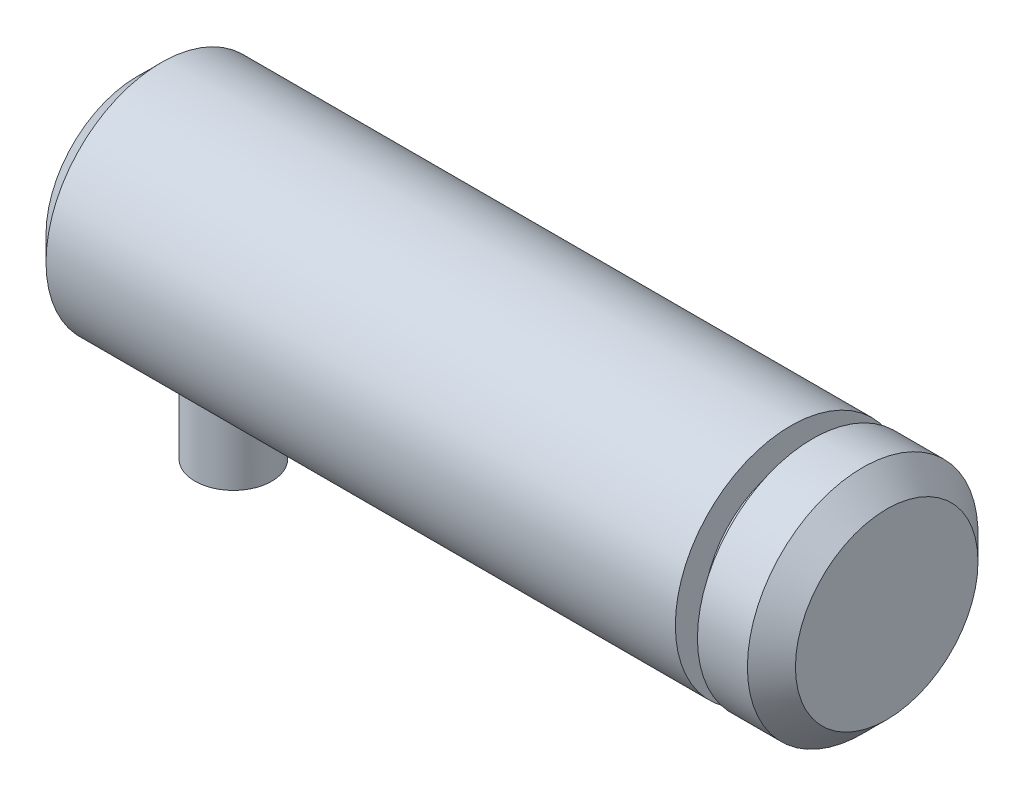
ISO-10303-21;
HEADER;
FILE_DESCRIPTION(('STEP AP214'),'2;1');
FILE_NAME('part.step','',(''),(''),'','','');
FILE_SCHEMA(('AUTOMOTIVE_DESIGN { 1 0 10303 214 1 1 1 1 }'));
ENDSEC;
DATA;
#1=APPLICATION_CONTEXT('core data for automotive mechanical design processes');
#2=APPLICATION_PROTOCOL_DEFINITION('international standard','automotive_design',2000,#1);
#3=PRODUCT_CONTEXT('',#1,'mechanical');
#4=PRODUCT('Part','Part','',(#3));
#5=PRODUCT_RELATED_PRODUCT_CATEGORY('part','',(#4));
#6=PRODUCT_DEFINITION_FORMATION('','',#4);
#7=PRODUCT_DEFINITION_CONTEXT('part definition',#1,'design');
#8=PRODUCT_DEFINITION('design','',#6,#7);
#9=PRODUCT_DEFINITION_SHAPE('','',#8);
#10=(LENGTH_UNIT() NAMED_UNIT(*) SI_UNIT(.MILLI.,.METRE.));
#11=(NAMED_UNIT(*) PLANE_ANGLE_UNIT() SI_UNIT($,.RADIAN.));
#12=(NAMED_UNIT(*) SI_UNIT($,.STERADIAN.) SOLID_ANGLE_UNIT());
#13=UNCERTAINTY_MEASURE_WITH_UNIT(LENGTH_MEASURE(1.E-05),#10,'distance_accuracy_value','');
#14=(GEOMETRIC_REPRESENTATION_CONTEXT(3) GLOBAL_UNCERTAINTY_ASSIGNED_CONTEXT((#13)) GLOBAL_UNIT_ASSIGNED_CONTEXT((#10,
#11,#12)) REPRESENTATION_CONTEXT('',''));
#15=CARTESIAN_POINT('',(0.,0.,0.));
#16=DIRECTION('',(0.,0.,1.));
#17=DIRECTION('',(1.,0.,0.));
#18=AXIS2_PLACEMENT_3D('',#15,#16,#17);
#19=CARTESIAN_POINT('',(14.5,0.,0.));
#20=DIRECTION('',(-1.,0.,0.));
#21=DIRECTION('',(0.,0.,1.));
#22=AXIS2_PLACEMENT_3D('',#19,#20,#21);
#23=CYLINDRICAL_SURFACE('',#22,6.);
#24=CARTESIAN_POINT('',(15.65,0.,0.));
#25=DIRECTION('',(-1.,0.,0.));
#26=DIRECTION('',(0.,0.,1.));
#27=AXIS2_PLACEMENT_3D('',#24,#25,#26);
#28=CIRCLE('',#27,6.);
#29=CARTESIAN_POINT('',(15.65,0.,6.));
#30=VERTEX_POINT('',#29);
#31=EDGE_CURVE('E58',#30,#30,#28,.T.);
#32=ORIENTED_EDGE('',*,*,#31,.F.);
#33=EDGE_LOOP('',(#32));
#34=FACE_BOUND('',#33,.T.);
#35=CARTESIAN_POINT('',(18.25,0.,0.));
#36=DIRECTION('',(-1.,0.,0.));
#37=DIRECTION('',(0.,0.,1.));
#38=AXIS2_PLACEMENT_3D('',#35,#36,#37);
#39=CIRCLE('',#38,6.);
#40=CARTESIAN_POINT('',(18.25,0.,6.));
#41=VERTEX_POINT('',#40);
#42=EDGE_CURVE('E67',#41,#41,#39,.T.);
#43=ORIENTED_EDGE('',*,*,#42,.T.);
#44=EDGE_LOOP('',(#43));
#45=FACE_BOUND('',#44,.T.);
#46=ADVANCED_FACE('F31',(#34,#45),#23,.T.);
#47=CARTESIAN_POINT('',(-18.25,0.,0.));
#48=DIRECTION('',(-1.,0.,0.));
#49=DIRECTION('',(0.,0.,1.));
#50=AXIS2_PLACEMENT_3D('',#47,#48,#49);
#51=CIRCLE('',#50,6.);
#52=CARTESIAN_POINT('',(-18.25,0.,6.));
#53=VERTEX_POINT('',#52);
#54=EDGE_CURVE('E10',#53,#53,#51,.T.);
#55=ORIENTED_EDGE('',*,*,#54,.F.);
#56=EDGE_LOOP('',(#55));
#57=FACE_BOUND('',#56,.T.);
#58=CARTESIAN_POINT('',(-14.5,-5.65685424949238,2.));
#59=CARTESIAN_POINT('',(-14.3910636503279,-5.65685389060868,2.00000051589543));
#60=CARTESIAN_POINT('',(-14.2821304003528,-5.66003538581715,1.99106956737105));
#61=CARTESIAN_POINT('',(-14.0674911580115,-5.6723514816251,1.95570226337762));
#62=CARTESIAN_POINT('',(-13.9617857002551,-5.68148706284377,1.92926302433679));
#63=CARTESIAN_POINT('',(-13.7567462140054,-5.70456407377583,1.85991097136981));
#64=CARTESIAN_POINT('',(-13.6574001411146,-5.71849607942644,1.81703044280649));
#65=CARTESIAN_POINT('',(-13.4672799029041,-5.74958244020649,1.71612325688276));
#66=CARTESIAN_POINT('',(-13.3765076348927,-5.76673750607225,1.65809325772037));
#67=CARTESIAN_POINT('',(-13.2025600753234,-5.80308978814946,1.52610229288575));
#68=CARTESIAN_POINT('',(-13.1197691426565,-5.82233789689288,1.45164868275584));
#69=CARTESIAN_POINT('',(-12.9675863975507,-5.86027729602006,1.28997533442879));
#70=CARTESIAN_POINT('',(-12.8981967368353,-5.87896849657923,1.20275355010475));
#71=CARTESIAN_POINT('',(-12.7730422053408,-5.91427733843598,1.01520901593002));
#72=CARTESIAN_POINT('',(-12.7176800587641,-5.93082815403211,0.914603822449048));
#73=CARTESIAN_POINT('',(-12.624816829745,-5.95939173541966,0.704862445974945));
#74=CARTESIAN_POINT('',(-12.5873109336462,-5.97140572406004,0.595728571374421));
#75=CARTESIAN_POINT('',(-12.5325282907352,-5.98918150863813,0.376057634866986));
#76=CARTESIAN_POINT('',(-12.514593107486,-5.99514629555118,0.265701509705934));
#77=CARTESIAN_POINT('',(-12.4973674132787,-6.00087216436496,0.0433957496481764));
#78=CARTESIAN_POINT('',(-12.4980720966952,-6.00063484525791,-0.0685534670877952));
#79=CARTESIAN_POINT('',(-12.5176885091321,-5.99412079237463,-0.286207030387632));
#80=CARTESIAN_POINT('',(-12.535885056949,-5.98808129510235,-0.391984097183315));
#81=CARTESIAN_POINT('',(-12.5887859619609,-5.97093934679463,-0.598886877644346));
#82=CARTESIAN_POINT('',(-12.6234914379597,-5.95983655262363,-0.700012275558434));
#83=CARTESIAN_POINT('',(-12.7088426346121,-5.93351340586448,-0.896304949683948));
#84=CARTESIAN_POINT('',(-12.759691877093,-5.91824085048031,-0.991376441937692));
#85=CARTESIAN_POINT('',(-12.8757194108973,-5.88516786077838,-1.17184865105465));
#86=CARTESIAN_POINT('',(-12.9409016866553,-5.86736672402934,-1.25724666877068));
#87=CARTESIAN_POINT('',(-13.0873487869194,-5.83012383699793,-1.42020173310262));
#88=CARTESIAN_POINT('',(-13.169226315683,-5.81064430337755,-1.49720031413055));
#89=CARTESIAN_POINT('',(-13.3448974514532,-5.77294670497801,-1.63655451919635));
#90=CARTESIAN_POINT('',(-13.4386928914561,-5.75472883491231,-1.69890788656309));
#91=CARTESIAN_POINT('',(-13.6373072512069,-5.72141050242224,-1.80797491007149));
#92=CARTESIAN_POINT('',(-13.7422642626356,-5.70635818569496,-1.85445292724268));
#93=CARTESIAN_POINT('',(-13.9591427884288,-5.68163301648769,-1.92888638653867));
#94=CARTESIAN_POINT('',(-14.0710613624125,-5.67195790974185,-1.95684959149499));
#95=CARTESIAN_POINT('',(-14.2932767108232,-5.6595927263117,-1.99232256419504));
#96=CARTESIAN_POINT('',(-14.4034188494973,-5.65660720637512,-2.00069819101527));
#97=CARTESIAN_POINT('',(-14.6235522982282,-5.65713344118369,-1.99921087781944));
#98=CARTESIAN_POINT('',(-14.733543632048,-5.66064401583629,-1.98935125045353));
#99=CARTESIAN_POINT('',(-14.9463139314238,-5.67347236180599,-1.95245130310462));
#100=CARTESIAN_POINT('',(-15.0492108603017,-5.68258650881681,-1.92601278796137));
#101=CARTESIAN_POINT('',(-15.2490872124784,-5.70537107342046,-1.85742772512093));
#102=CARTESIAN_POINT('',(-15.3460655831816,-5.71904229869679,-1.81527839272684));
#103=CARTESIAN_POINT('',(-15.534760841694,-5.74993755191574,-1.71494868147787));
#104=CARTESIAN_POINT('',(-15.6262132852836,-5.76726051331257,-1.65630223671699));
#105=CARTESIAN_POINT('',(-15.7982921047674,-5.8033153746193,-1.52517126111512));
#106=CARTESIAN_POINT('',(-15.8789152773224,-5.82204768887589,-1.45268265099756));
#107=CARTESIAN_POINT('',(-16.0310559681813,-5.85990077275698,-1.29178341180065));
#108=CARTESIAN_POINT('',(-16.1019487800377,-5.87899687155793,-1.2027745410933));
#109=CARTESIAN_POINT('',(-16.2278322846961,-5.91453703226217,-1.01365458280051));
#110=CARTESIAN_POINT('',(-16.2828235423248,-5.93098118835389,-0.913543889729102));
#111=CARTESIAN_POINT('',(-16.3748402097234,-5.95928811621206,-0.705559724864588));
#112=CARTESIAN_POINT('',(-16.4119825542961,-5.97118060009062,-0.59774224664239));
#113=CARTESIAN_POINT('',(-16.4674554841202,-5.98917221675549,-0.37691693169203));
#114=CARTESIAN_POINT('',(-16.485792859761,-5.99527344068037,-0.263910983907776));
#115=CARTESIAN_POINT('',(-16.5025241552113,-6.00083726472513,-0.0416306717200793));
#116=CARTESIAN_POINT('',(-16.5018149078648,-6.00059840178878,0.0675694478400396));
#117=CARTESIAN_POINT('',(-16.4826853837072,-5.99424393038796,0.28422229000035));
#118=CARTESIAN_POINT('',(-16.4642665436945,-5.98812879867152,0.391675153638115));
#119=CARTESIAN_POINT('',(-16.4108355308481,-5.97081829908825,0.600084238864119));
#120=CARTESIAN_POINT('',(-16.3760915692941,-5.95970516722297,0.70111654182558));
#121=CARTESIAN_POINT('',(-16.2912449378057,-5.9335432140899,0.895956701879593));
#122=CARTESIAN_POINT('',(-16.241139489606,-5.91849368096033,0.989763248284866));
#123=CARTESIAN_POINT('',(-16.124860975796,-5.88531737655762,1.17126803261757));
#124=CARTESIAN_POINT('',(-16.0581626292367,-5.86709744983853,1.25861250311522));
#125=CARTESIAN_POINT('',(-15.9114852176876,-5.82985977583759,1.42116205254486));
#126=CARTESIAN_POINT('',(-15.8315019154745,-5.81084177546194,1.49636324324919));
#127=CARTESIAN_POINT('',(-15.6567812888261,-5.77326559651196,1.63548361766624));
#128=CARTESIAN_POINT('',(-15.5615889780467,-5.75475455977261,1.6988459319958));
#129=CARTESIAN_POINT('',(-15.3613311461944,-5.72120386646031,1.80862868660223));
#130=CARTESIAN_POINT('',(-15.2562682139407,-5.70616330322499,1.85505355363895));
#131=CARTESIAN_POINT('',(-15.0440763519687,-5.68202668413029,1.92768765640833));
#132=CARTESIAN_POINT('',(-14.9372554729493,-5.67269265714364,1.95471581829904));
#133=CARTESIAN_POINT('',(-14.7202878990666,-5.66010767079036,1.99086864029853));
#134=CARTESIAN_POINT('',(-14.6101423651786,-5.65685461234922,1.99999947839318));
#135=CARTESIAN_POINT('',(-14.5,-5.65685424949238,2.));
#136=B_SPLINE_CURVE_WITH_KNOTS('',3,(#58,#59,#60,#61,#62,#63,#64,#65,#66,#67,#68,#69,#70,#71,
#72,#73,#74,#75,#76,#77,#78,#79,#80,#81,#82,#83,#84,#85,#86,#87,#88,#89,#90,#91,#92,#93,#94,#95,
#96,#97,#98,#99,#100,#101,#102,#103,#104,#105,#106,#107,#108,#109,#110,#111,#112,#113,#114,#115,
#116,#117,#118,#119,#120,#121,#122,#123,#124,#125,#126,#127,#128,#129,#130,#131,#132,#133,#134,
#135),.UNSPECIFIED.,.T.,.F.,(4,2,2,2,2,2,2,2,2,2,2,2,2,2,2,2,2,2,2,2,2,2,2,2,2,2,2,2,2,2,2,2,2,
2,2,2,2,2,4),(0.,0.326401169598712,0.652856110030329,0.978673255001655,1.30456233237089,
1.64202674855136,1.97954530343976,2.32587012287315,2.67210152773578,3.00628637529869,
3.34038506604655,3.66138009651138,3.98239688378474,4.3076330972067,4.63295983748044,
4.97360348727835,5.31429959224212,5.65985279686111,6.00526102713232,6.33508582728879,
6.66485071674468,6.98328791537553,7.30178158293892,7.6303771547143,7.95906971324255,
8.30357616342185,8.64807037515065,8.99027582381703,9.33235766008313,9.65836169355271,
9.98433928019562,10.3051391208086,10.6259970152649,10.9587103904127,11.2915300886526,
11.6373780547229,11.9831355653373,12.3132642432538,12.6432789438093),.UNSPECIFIED.);
#137=CARTESIAN_POINT('',(-14.5,-5.65685424949238,2.));
#138=VERTEX_POINT('',#137);
#139=EDGE_CURVE('E35',#138,#138,#136,.T.);
#140=ORIENTED_EDGE('',*,*,#139,.T.);
#141=EDGE_LOOP('',(#140));
#142=FACE_BOUND('',#141,.T.);
#143=CARTESIAN_POINT('',(14.5,0.,0.));
#144=DIRECTION('',(-1.,0.,0.));
#145=DIRECTION('',(0.,0.,1.));
#146=AXIS2_PLACEMENT_3D('',#143,#144,#145);
#147=CIRCLE('',#146,6.);
#148=CARTESIAN_POINT('',(14.5,0.,6.));
#149=VERTEX_POINT('',#148);
#150=EDGE_CURVE('E61',#149,#149,#147,.T.);
#151=ORIENTED_EDGE('',*,*,#150,.T.);
#152=EDGE_LOOP('',(#151));
#153=FACE_BOUND('',#152,.T.);
#154=ADVANCED_FACE('F88',(#57,#142,#153),#23,.T.);
#155=CARTESIAN_POINT('',(-19.5,0.,0.));
#156=DIRECTION('',(1.,0.,0.));
#157=DIRECTION('',(0.,0.,-1.));
#158=AXIS2_PLACEMENT_3D('',#155,#156,#157);
#159=CONICAL_SURFACE('',#158,4.75,0.785398163397448);
#160=ORIENTED_EDGE('',*,*,#54,.T.);
#161=EDGE_LOOP('',(#160));
#162=FACE_BOUND('',#161,.T.);
#163=CARTESIAN_POINT('',(-19.5,0.,0.));
#164=DIRECTION('',(-1.,0.,0.));
#165=DIRECTION('',(0.,0.,1.));
#166=AXIS2_PLACEMENT_3D('',#163,#164,#165);
#167=CIRCLE('',#166,4.75);
#168=CARTESIAN_POINT('',(-19.5,0.,4.75));
#169=VERTEX_POINT('',#168);
#170=EDGE_CURVE('E43',#169,#169,#167,.T.);
#171=ORIENTED_EDGE('',*,*,#170,.F.);
#172=EDGE_LOOP('',(#171));
#173=FACE_BOUND('',#172,.T.);
#174=ADVANCED_FACE('F93',(#162,#173),#159,.T.);
#175=CARTESIAN_POINT('',(-19.5,0.,0.));
#176=DIRECTION('',(1.,0.,0.));
#177=DIRECTION('',(0.,0.,-1.));
#178=AXIS2_PLACEMENT_3D('',#175,#176,#177);
#179=PLANE('',#178);
#180=ORIENTED_EDGE('',*,*,#170,.T.);
#181=EDGE_LOOP('',(#180));
#182=FACE_BOUND('',#181,.T.);
#183=ADVANCED_FACE('F33',(#182),#179,.F.);
#184=CARTESIAN_POINT('',(-14.5,-10.,0.));
#185=DIRECTION('',(0.,1.,0.));
#186=DIRECTION('',(0.,0.,1.));
#187=AXIS2_PLACEMENT_3D('',#184,#185,#186);
#188=CYLINDRICAL_SURFACE('',#187,2.);
#189=CARTESIAN_POINT('',(-14.5,-10.,0.));
#190=DIRECTION('',(0.,1.,0.));
#191=DIRECTION('',(0.,0.,1.));
#192=AXIS2_PLACEMENT_3D('',#189,#190,#191);
#193=CIRCLE('',#192,2.);
#194=CARTESIAN_POINT('',(-14.5,-10.,2.));
#195=VERTEX_POINT('',#194);
#196=EDGE_CURVE('E49',#195,#195,#193,.T.);
#197=ORIENTED_EDGE('',*,*,#196,.T.);
#198=EDGE_LOOP('',(#197));
#199=FACE_BOUND('',#198,.T.);
#200=ORIENTED_EDGE('',*,*,#139,.F.);
#201=EDGE_LOOP('',(#200));
#202=FACE_BOUND('',#201,.T.);
#203=ADVANCED_FACE('F99',(#199,#202),#188,.T.);
#204=CARTESIAN_POINT('',(-14.5,-10.,0.));
#205=DIRECTION('',(0.,1.,0.));
#206=DIRECTION('',(0.,0.,1.));
#207=AXIS2_PLACEMENT_3D('',#204,#205,#206);
#208=PLANE('',#207);
#209=ORIENTED_EDGE('',*,*,#196,.F.);
#210=EDGE_LOOP('',(#209));
#211=FACE_BOUND('',#210,.T.);
#212=ADVANCED_FACE('F103',(#211),#208,.F.);
#213=CARTESIAN_POINT('',(14.5,6.,0.));
#214=DIRECTION('',(1.,0.,0.));
#215=DIRECTION('',(0.,0.,-1.));
#216=AXIS2_PLACEMENT_3D('',#213,#214,#215);
#217=PLANE('',#216);
#218=CARTESIAN_POINT('',(14.5,0.,0.));
#219=DIRECTION('',(-1.,0.,0.));
#220=DIRECTION('',(0.,0.,1.));
#221=AXIS2_PLACEMENT_3D('',#218,#219,#220);
#222=CIRCLE('',#221,4.5);
#223=CARTESIAN_POINT('',(14.5,0.,4.5));
#224=VERTEX_POINT('',#223);
#225=EDGE_CURVE('E52',#224,#224,#222,.T.);
#226=ORIENTED_EDGE('',*,*,#225,.T.);
#227=EDGE_LOOP('',(#226));
#228=FACE_BOUND('',#227,.T.);
#229=ORIENTED_EDGE('',*,*,#150,.F.);
#230=EDGE_LOOP('',(#229));
#231=FACE_BOUND('',#230,.T.);
#232=ADVANCED_FACE('F106',(#228,#231),#217,.T.);
#233=CARTESIAN_POINT('',(29.,0.,0.));
#234=DIRECTION('',(-1.,0.,0.));
#235=DIRECTION('',(0.,0.,1.));
#236=AXIS2_PLACEMENT_3D('',#233,#234,#235);
#237=CYLINDRICAL_SURFACE('',#236,4.5);
#238=CARTESIAN_POINT('',(15.65,0.,0.));
#239=DIRECTION('',(-1.,0.,0.));
#240=DIRECTION('',(0.,0.,1.));
#241=AXIS2_PLACEMENT_3D('',#238,#239,#240);
#242=CIRCLE('',#241,4.5);
#243=CARTESIAN_POINT('',(15.65,0.,4.5));
#244=VERTEX_POINT('',#243);
#245=EDGE_CURVE('E55',#244,#244,#242,.T.);
#246=ORIENTED_EDGE('',*,*,#245,.T.);
#247=EDGE_LOOP('',(#246));
#248=FACE_BOUND('',#247,.T.);
#249=ORIENTED_EDGE('',*,*,#225,.F.);
#250=EDGE_LOOP('',(#249));
#251=FACE_BOUND('',#250,.T.);
#252=ADVANCED_FACE('F84',(#248,#251),#237,.T.);
#253=CARTESIAN_POINT('',(15.65,4.5,0.));
#254=DIRECTION('',(-1.,0.,0.));
#255=DIRECTION('',(0.,0.,1.));
#256=AXIS2_PLACEMENT_3D('',#253,#254,#255);
#257=PLANE('',#256);
#258=ORIENTED_EDGE('',*,*,#31,.T.);
#259=EDGE_LOOP('',(#258));
#260=FACE_BOUND('',#259,.T.);
#261=ORIENTED_EDGE('',*,*,#245,.F.);
#262=EDGE_LOOP('',(#261));
#263=FACE_BOUND('',#262,.T.);
#264=ADVANCED_FACE('F75',(#260,#263),#257,.T.);
#265=CARTESIAN_POINT('',(18.25,0.,0.));
#266=DIRECTION('',(-1.,0.,0.));
#267=DIRECTION('',(0.,0.,1.));
#268=AXIS2_PLACEMENT_3D('',#265,#266,#267);
#269=CONICAL_SURFACE('',#268,6.,0.785398163397448);
#270=CARTESIAN_POINT('',(19.5,0.,0.));
#271=DIRECTION('',(-1.,0.,0.));
#272=DIRECTION('',(0.,0.,1.));
#273=AXIS2_PLACEMENT_3D('',#270,#271,#272);
#274=CIRCLE('',#273,4.75);
#275=CARTESIAN_POINT('',(19.5,0.,4.75));
#276=VERTEX_POINT('',#275);
#277=EDGE_CURVE('E64',#276,#276,#274,.T.);
#278=ORIENTED_EDGE('',*,*,#277,.T.);
#279=EDGE_LOOP('',(#278));
#280=FACE_BOUND('',#279,.T.);
#281=ORIENTED_EDGE('',*,*,#42,.F.);
#282=EDGE_LOOP('',(#281));
#283=FACE_BOUND('',#282,.T.);
#284=ADVANCED_FACE('F72',(#280,#283),#269,.T.);
#285=CARTESIAN_POINT('',(19.5,6.,0.));
#286=DIRECTION('',(-1.,0.,0.));
#287=DIRECTION('',(0.,0.,1.));
#288=AXIS2_PLACEMENT_3D('',#285,#286,#287);
#289=PLANE('',#288);
#290=ORIENTED_EDGE('',*,*,#277,.F.);
#291=EDGE_LOOP('',(#290));
#292=FACE_BOUND('',#291,.T.);
#293=ADVANCED_FACE('F74',(#292),#289,.F.);
#294=CLOSED_SHELL('',(#46,#154,#174,#183,#203,#212,#232,#252,#264,#284,#293));
#295=MANIFOLD_SOLID_BREP('B2',#294);
#296=ADVANCED_BREP_SHAPE_REPRESENTATION('',(#18,#295),#14);
#297=SHAPE_DEFINITION_REPRESENTATION(#9,#296);
ENDSEC;
END-ISO-10303-21;
